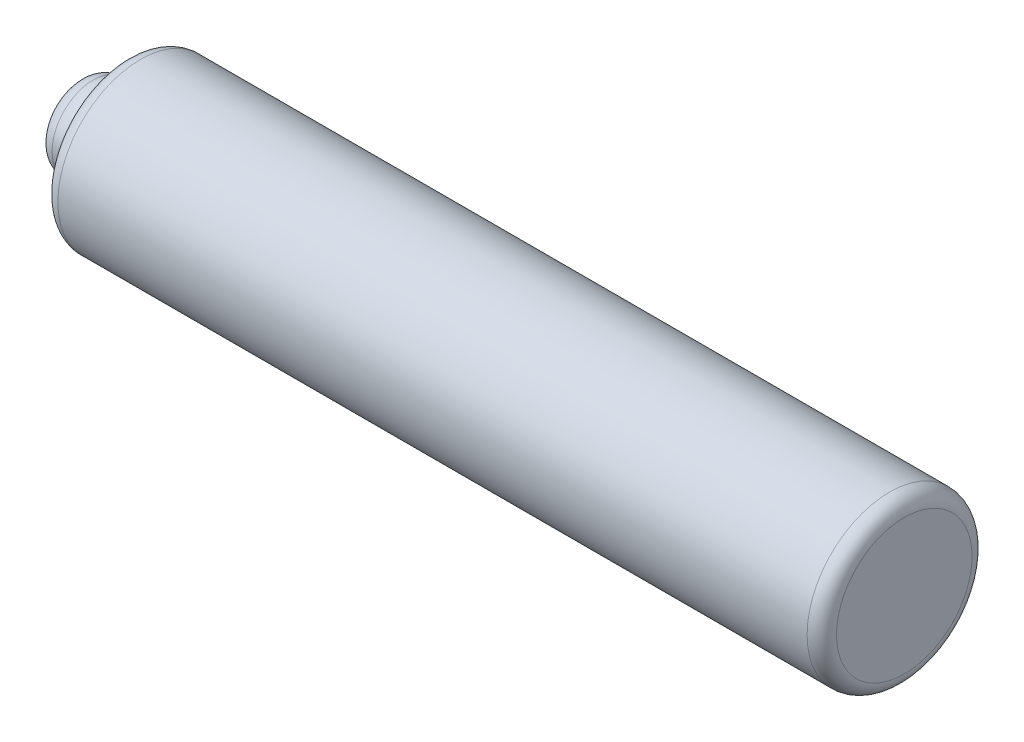
ISO-10303-21;
HEADER;
FILE_DESCRIPTION(('STEP AP214'),'2;1');
FILE_NAME('part.step','',(''),(''),'','','');
FILE_SCHEMA(('AUTOMOTIVE_DESIGN { 1 0 10303 214 1 1 1 1 }'));
ENDSEC;
DATA;
#1=APPLICATION_CONTEXT('core data for automotive mechanical design processes');
#2=APPLICATION_PROTOCOL_DEFINITION('international standard','automotive_design',2000,#1);
#3=PRODUCT_CONTEXT('',#1,'mechanical');
#4=PRODUCT('Part','Part','',(#3));
#5=PRODUCT_RELATED_PRODUCT_CATEGORY('part','',(#4));
#6=PRODUCT_DEFINITION_FORMATION('','',#4);
#7=PRODUCT_DEFINITION_CONTEXT('part definition',#1,'design');
#8=PRODUCT_DEFINITION('design','',#6,#7);
#9=PRODUCT_DEFINITION_SHAPE('','',#8);
#10=(LENGTH_UNIT() NAMED_UNIT(*) SI_UNIT(.MILLI.,.METRE.));
#11=(NAMED_UNIT(*) PLANE_ANGLE_UNIT() SI_UNIT($,.RADIAN.));
#12=(NAMED_UNIT(*) SI_UNIT($,.STERADIAN.) SOLID_ANGLE_UNIT());
#13=UNCERTAINTY_MEASURE_WITH_UNIT(LENGTH_MEASURE(1.E-05),#10,'distance_accuracy_value','');
#14=(GEOMETRIC_REPRESENTATION_CONTEXT(3) GLOBAL_UNCERTAINTY_ASSIGNED_CONTEXT((#13)) GLOBAL_UNIT_ASSIGNED_CONTEXT((#10,
#11,#12)) REPRESENTATION_CONTEXT('',''));
#15=CARTESIAN_POINT('',(0.,0.,0.));
#16=DIRECTION('',(0.,0.,1.));
#17=DIRECTION('',(1.,0.,0.));
#18=AXIS2_PLACEMENT_3D('',#15,#16,#17);
#19=CARTESIAN_POINT('',(-45.8444420621101,0.,-21.4948862809899));
#20=DIRECTION('',(1.,0.,0.));
#21=DIRECTION('',(0.,0.,-1.));
#22=AXIS2_PLACEMENT_3D('',#19,#20,#21);
#23=PLANE('',#22);
#24=CARTESIAN_POINT('',(-45.8444420621101,0.,-17.2152059831655));
#25=DIRECTION('',(1.,0.,0.));
#26=DIRECTION('',(0.,0.,-1.));
#27=AXIS2_PLACEMENT_3D('',#24,#25,#26);
#28=CIRCLE('',#27,3.51768029782438);
#29=CARTESIAN_POINT('',(-45.8444420621101,0.,-20.7328862809899));
#30=VERTEX_POINT('',#29);
#31=EDGE_CURVE('E52',#30,#30,#28,.F.);
#32=ORIENTED_EDGE('',*,*,#31,.T.);
#33=EDGE_LOOP('',(#32));
#34=FACE_BOUND('',#33,.T.);
#35=CARTESIAN_POINT('',(-45.8444420621101,0.,-17.2152059831655));
#36=DIRECTION('',(-1.,0.,0.));
#37=DIRECTION('',(0.,0.,1.));
#38=AXIS2_PLACEMENT_3D('',#35,#36,#37);
#39=CIRCLE('',#38,2.13984014891219);
#40=CARTESIAN_POINT('',(-45.8444420621101,0.,-15.0753658342533));
#41=VERTEX_POINT('',#40);
#42=EDGE_CURVE('E63',#41,#41,#39,.T.);
#43=ORIENTED_EDGE('',*,*,#42,.F.);
#44=EDGE_LOOP('',(#43));
#45=FACE_BOUND('',#44,.T.);
#46=ADVANCED_FACE('F37',(#34,#45),#23,.F.);
#47=CARTESIAN_POINT('',(-45.8444420621101,0.,-17.2152059831655));
#48=DIRECTION('',(-1.,0.,0.));
#49=DIRECTION('',(0.,0.,1.));
#50=AXIS2_PLACEMENT_3D('',#47,#48,#49);
#51=CYLINDRICAL_SURFACE('',#50,4.27968029782438);
#52=CARTESIAN_POINT('',(-45.0824420621101,0.,-17.2152059831655));
#53=DIRECTION('',(1.,0.,0.));
#54=DIRECTION('',(0.,0.,-1.));
#55=AXIS2_PLACEMENT_3D('',#52,#53,#54);
#56=CIRCLE('',#55,4.27968029782438);
#57=CARTESIAN_POINT('',(-45.0824420621101,0.,-21.4948862809899));
#58=VERTEX_POINT('',#57);
#59=EDGE_CURVE('E44',#58,#58,#56,.T.);
#60=ORIENTED_EDGE('',*,*,#59,.T.);
#61=EDGE_LOOP('',(#60));
#62=FACE_BOUND('',#61,.T.);
#63=CARTESIAN_POINT('',(-6.21334098603914,0.,-17.2152059831655));
#64=DIRECTION('',(-1.,0.,0.));
#65=DIRECTION('',(0.,0.,1.));
#66=AXIS2_PLACEMENT_3D('',#63,#64,#65);
#67=CIRCLE('',#66,4.27968029782438);
#68=CARTESIAN_POINT('',(-6.21334098603914,0.,-12.9355256853412));
#69=VERTEX_POINT('',#68);
#70=EDGE_CURVE('E48',#69,#69,#67,.T.);
#71=ORIENTED_EDGE('',*,*,#70,.T.);
#72=EDGE_LOOP('',(#71));
#73=FACE_BOUND('',#72,.T.);
#74=ADVANCED_FACE('F70',(#62,#73),#51,.T.);
#75=CARTESIAN_POINT('',(-5.45134098603915,0.,-21.4948862809899));
#76=DIRECTION('',(-1.,0.,0.));
#77=DIRECTION('',(0.,0.,1.));
#78=AXIS2_PLACEMENT_3D('',#75,#76,#77);
#79=PLANE('',#78);
#80=CARTESIAN_POINT('',(-5.45134098603915,0.,-17.2152059831655));
#81=DIRECTION('',(-1.,0.,0.));
#82=DIRECTION('',(0.,0.,1.));
#83=AXIS2_PLACEMENT_3D('',#80,#81,#82);
#84=CIRCLE('',#83,3.51768029782438);
#85=CARTESIAN_POINT('',(-5.45134098603915,0.,-13.6975256853412));
#86=VERTEX_POINT('',#85);
#87=EDGE_CURVE('E10',#86,#86,#84,.F.);
#88=ORIENTED_EDGE('',*,*,#87,.T.);
#89=EDGE_LOOP('',(#88));
#90=FACE_BOUND('',#89,.T.);
#91=ADVANCED_FACE('F76',(#90),#79,.F.);
#92=CARTESIAN_POINT('',(-48.2853810234775,0.,-19.3550461320777));
#93=DIRECTION('',(1.,0.,0.));
#94=DIRECTION('',(0.,0.,-1.));
#95=AXIS2_PLACEMENT_3D('',#92,#93,#94);
#96=PLANE('',#95);
#97=CARTESIAN_POINT('',(-48.2853810234775,0.,-17.2152059831655));
#98=DIRECTION('',(1.,0.,0.));
#99=DIRECTION('',(0.,0.,-1.));
#100=AXIS2_PLACEMENT_3D('',#97,#98,#99);
#101=CIRCLE('',#100,1.37784014891219);
#102=CARTESIAN_POINT('',(-48.2853810234775,0.,-18.5930461320777));
#103=VERTEX_POINT('',#102);
#104=EDGE_CURVE('E60',#103,#103,#101,.F.);
#105=ORIENTED_EDGE('',*,*,#104,.T.);
#106=EDGE_LOOP('',(#105));
#107=FACE_BOUND('',#106,.T.);
#108=ADVANCED_FACE('F116',(#107),#96,.F.);
#109=CARTESIAN_POINT('',(-45.8444420621101,0.,-17.2152059831655));
#110=DIRECTION('',(-1.,0.,0.));
#111=DIRECTION('',(0.,0.,1.));
#112=AXIS2_PLACEMENT_3D('',#109,#110,#111);
#113=CYLINDRICAL_SURFACE('',#112,2.13984014891219);
#114=CARTESIAN_POINT('',(-47.5233810234775,0.,-17.2152059831655));
#115=DIRECTION('',(1.,0.,0.));
#116=DIRECTION('',(0.,0.,-1.));
#117=AXIS2_PLACEMENT_3D('',#114,#115,#116);
#118=CIRCLE('',#117,2.13984014891219);
#119=CARTESIAN_POINT('',(-47.5233810234775,0.,-19.3550461320777));
#120=VERTEX_POINT('',#119);
#121=EDGE_CURVE('E57',#120,#120,#118,.T.);
#122=ORIENTED_EDGE('',*,*,#121,.T.);
#123=EDGE_LOOP('',(#122));
#124=FACE_BOUND('',#123,.T.);
#125=ORIENTED_EDGE('',*,*,#42,.T.);
#126=EDGE_LOOP('',(#125));
#127=FACE_BOUND('',#126,.T.);
#128=ADVANCED_FACE('F67',(#124,#127),#113,.T.);
#129=CARTESIAN_POINT('',(-47.5233810234775,0.,-17.2152059831655));
#130=DIRECTION('',(1.,0.,0.));
#131=DIRECTION('',(0.,0.,-1.));
#132=AXIS2_PLACEMENT_3D('',#129,#130,#131);
#133=TOROIDAL_SURFACE('',#132,1.37784014891219,0.762);
#134=ORIENTED_EDGE('',*,*,#121,.F.);
#135=EDGE_LOOP('',(#134));
#136=FACE_BOUND('',#135,.T.);
#137=ORIENTED_EDGE('',*,*,#104,.F.);
#138=EDGE_LOOP('',(#137));
#139=FACE_BOUND('',#138,.T.);
#140=ADVANCED_FACE('F80',(#136,#139),#133,.T.);
#141=CARTESIAN_POINT('',(-45.0824420621101,0.,-17.2152059831655));
#142=DIRECTION('',(1.,0.,0.));
#143=DIRECTION('',(0.,0.,-1.));
#144=AXIS2_PLACEMENT_3D('',#141,#142,#143);
#145=TOROIDAL_SURFACE('',#144,3.51768029782438,0.762);
#146=ORIENTED_EDGE('',*,*,#59,.F.);
#147=EDGE_LOOP('',(#146));
#148=FACE_BOUND('',#147,.T.);
#149=ORIENTED_EDGE('',*,*,#31,.F.);
#150=EDGE_LOOP('',(#149));
#151=FACE_BOUND('',#150,.T.);
#152=ADVANCED_FACE('F82',(#148,#151),#145,.T.);
#153=CARTESIAN_POINT('',(-6.21334098603914,0.,-17.2152059831655));
#154=DIRECTION('',(-1.,0.,0.));
#155=DIRECTION('',(0.,0.,1.));
#156=AXIS2_PLACEMENT_3D('',#153,#154,#155);
#157=TOROIDAL_SURFACE('',#156,3.51768029782438,0.762);
#158=ORIENTED_EDGE('',*,*,#87,.F.);
#159=EDGE_LOOP('',(#158));
#160=FACE_BOUND('',#159,.T.);
#161=ORIENTED_EDGE('',*,*,#70,.F.);
#162=EDGE_LOOP('',(#161));
#163=FACE_BOUND('',#162,.T.);
#164=ADVANCED_FACE('F39',(#160,#163),#157,.T.);
#165=CLOSED_SHELL('',(#46,#74,#91,#108,#128,#140,#152,#164));
#166=MANIFOLD_SOLID_BREP('B2',#165);
#167=ADVANCED_BREP_SHAPE_REPRESENTATION('',(#18,#166),#14);
#168=SHAPE_DEFINITION_REPRESENTATION(#9,#167);
ENDSEC;
END-ISO-10303-21;
